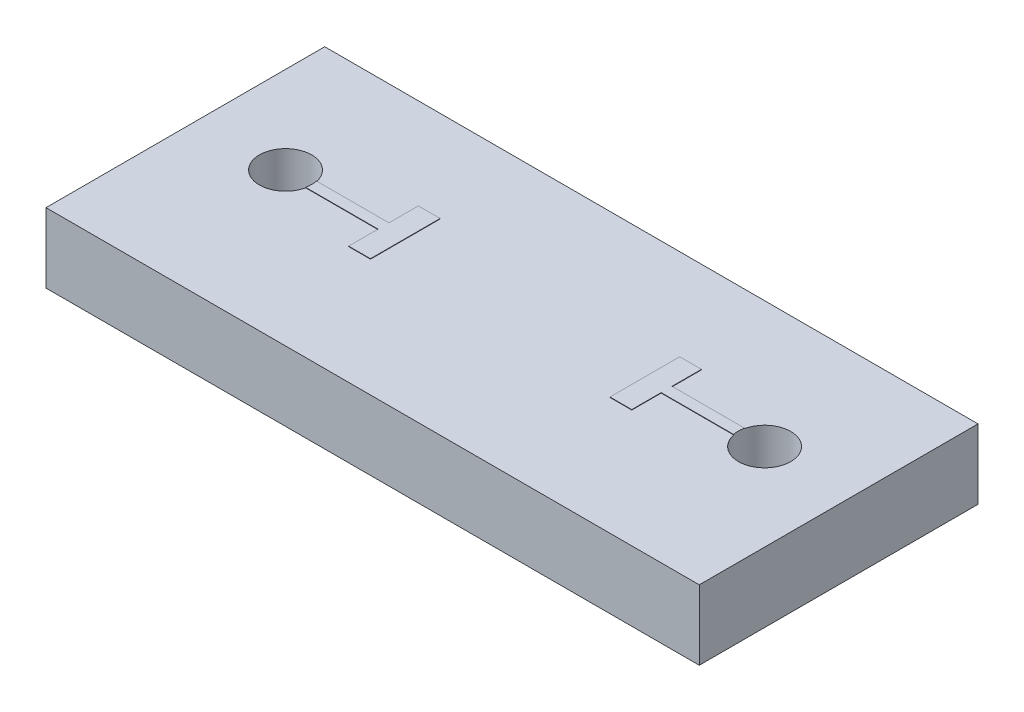
ISO-10303-21;
HEADER;
FILE_DESCRIPTION(('STEP AP214'),'2;1');
FILE_NAME('part.step','',(''),(''),'','','');
FILE_SCHEMA(('AUTOMOTIVE_DESIGN { 1 0 10303 214 1 1 1 1 }'));
ENDSEC;
DATA;
#1=APPLICATION_CONTEXT('core data for automotive mechanical design processes');
#2=APPLICATION_PROTOCOL_DEFINITION('international standard','automotive_design',2000,#1);
#3=PRODUCT_CONTEXT('',#1,'mechanical');
#4=PRODUCT('Part','Part','',(#3));
#5=PRODUCT_RELATED_PRODUCT_CATEGORY('part','',(#4));
#6=PRODUCT_DEFINITION_FORMATION('','',#4);
#7=PRODUCT_DEFINITION_CONTEXT('part definition',#1,'design');
#8=PRODUCT_DEFINITION('design','',#6,#7);
#9=PRODUCT_DEFINITION_SHAPE('','',#8);
#10=(LENGTH_UNIT() NAMED_UNIT(*) SI_UNIT(.MILLI.,.METRE.));
#11=(NAMED_UNIT(*) PLANE_ANGLE_UNIT() SI_UNIT($,.RADIAN.));
#12=(NAMED_UNIT(*) SI_UNIT($,.STERADIAN.) SOLID_ANGLE_UNIT());
#13=UNCERTAINTY_MEASURE_WITH_UNIT(LENGTH_MEASURE(1.E-05),#10,'distance_accuracy_value','');
#14=(GEOMETRIC_REPRESENTATION_CONTEXT(3) GLOBAL_UNCERTAINTY_ASSIGNED_CONTEXT((#13)) GLOBAL_UNIT_ASSIGNED_CONTEXT((#10,
#11,#12)) REPRESENTATION_CONTEXT('',''));
#15=CARTESIAN_POINT('',(0.,0.,0.));
#16=DIRECTION('',(0.,0.,1.));
#17=DIRECTION('',(1.,0.,0.));
#18=AXIS2_PLACEMENT_3D('',#15,#16,#17);
#19=CARTESIAN_POINT('',(0.,1.6,0.));
#20=DIRECTION('',(0.,-1.,0.));
#21=DIRECTION('',(0.,0.,-1.));
#22=AXIS2_PLACEMENT_3D('',#19,#20,#21);
#23=PLANE('',#22);
#24=DIRECTION('',(-1.,0.,0.));
#25=VECTOR('',#24,1.);
#26=CARTESIAN_POINT('',(0.,1.6,-0.124999999999995));
#27=LINE('',#26,#25);
#28=CARTESIAN_POINT('',(4.91316527028473,1.6,-0.12499999999999));
#29=VERTEX_POINT('',#28);
#30=CARTESIAN_POINT('',(3.25000000000001,1.6,-0.124999999999997));
#31=VERTEX_POINT('',#30);
#32=EDGE_CURVE('E232',#29,#31,#27,.T.);
#33=ORIENTED_EDGE('',*,*,#32,.F.);
#34=CARTESIAN_POINT('',(5.50000000000001,1.6,0.));
#35=DIRECTION('',(0.,1.,0.));
#36=DIRECTION('',(0.,0.,1.));
#37=AXIS2_PLACEMENT_3D('',#34,#35,#36);
#38=CIRCLE('',#37,0.6);
#39=CARTESIAN_POINT('',(4.91316527028473,1.6,0.125000000000004));
#40=VERTEX_POINT('',#39);
#41=EDGE_CURVE('E324',#40,#29,#38,.T.);
#42=ORIENTED_EDGE('',*,*,#41,.F.);
#43=DIRECTION('',(-1.,0.,0.));
#44=VECTOR('',#43,1.);
#45=CARTESIAN_POINT('',(0.,1.6,0.125));
#46=LINE('',#45,#44);
#47=CARTESIAN_POINT('',(3.25000000000001,1.6,0.124999999999995));
#48=VERTEX_POINT('',#47);
#49=EDGE_CURVE('E237',#40,#48,#46,.T.);
#50=ORIENTED_EDGE('',*,*,#49,.T.);
#51=DIRECTION('',(0.,0.,-1.));
#52=VECTOR('',#51,1.);
#53=CARTESIAN_POINT('',(3.25,1.6,0.));
#54=LINE('',#53,#52);
#55=CARTESIAN_POINT('',(3.25,1.6,0.799999999999999));
#56=VERTEX_POINT('',#55);
#57=EDGE_CURVE('E304',#56,#48,#54,.T.);
#58=ORIENTED_EDGE('',*,*,#57,.F.);
#59=DIRECTION('',(-1.,0.,0.));
#60=VECTOR('',#59,1.);
#61=CARTESIAN_POINT('',(0.,1.6,0.799999999999999));
#62=LINE('',#61,#60);
#63=CARTESIAN_POINT('',(2.75,1.59999999999999,0.800000000000004));
#64=VERTEX_POINT('',#63);
#65=EDGE_CURVE('E301',#56,#64,#62,.T.);
#66=ORIENTED_EDGE('',*,*,#65,.T.);
#67=DIRECTION('',(0.,0.,-1.));
#68=VECTOR('',#67,1.);
#69=CARTESIAN_POINT('',(2.75,1.6,0.));
#70=LINE('',#69,#68);
#71=CARTESIAN_POINT('',(2.75,1.6,-0.799999999999999));
#72=VERTEX_POINT('',#71);
#73=EDGE_CURVE('E285',#64,#72,#70,.T.);
#74=ORIENTED_EDGE('',*,*,#73,.T.);
#75=DIRECTION('',(-1.,0.,0.));
#76=VECTOR('',#75,1.);
#77=CARTESIAN_POINT('',(0.,1.6,-0.799999999999999));
#78=LINE('',#77,#76);
#79=CARTESIAN_POINT('',(3.25,1.6,-0.800000000000001));
#80=VERTEX_POINT('',#79);
#81=EDGE_CURVE('E290',#80,#72,#78,.T.);
#82=ORIENTED_EDGE('',*,*,#81,.F.);
#83=EDGE_CURVE('E303',#31,#80,#54,.T.);
#84=ORIENTED_EDGE('',*,*,#83,.F.);
#85=EDGE_LOOP('',(#33,#42,#50,#58,#66,#74,#82,#84));
#86=FACE_BOUND('',#85,.T.);
#87=DIRECTION('',(0.,0.,-1.));
#88=VECTOR('',#87,1.);
#89=CARTESIAN_POINT('',(7.5,1.6,2.00000000000001));
#90=LINE('',#89,#88);
#91=CARTESIAN_POINT('',(7.50000000000001,1.60000000000001,3.50000000000002));
#92=VERTEX_POINT('',#91);
#93=CARTESIAN_POINT('',(7.5,1.59999999999999,-2.9));
#94=VERTEX_POINT('',#93);
#95=EDGE_CURVE('E49',#92,#94,#90,.T.);
#96=ORIENTED_EDGE('',*,*,#95,.T.);
#97=DIRECTION('',(1.,0.,0.));
#98=VECTOR('',#97,1.);
#99=CARTESIAN_POINT('',(-7.5,1.6,-2.9));
#100=LINE('',#99,#98);
#101=CARTESIAN_POINT('',(-7.5,1.6,-2.9));
#102=VERTEX_POINT('',#101);
#103=EDGE_CURVE('E187',#102,#94,#100,.T.);
#104=ORIENTED_EDGE('',*,*,#103,.F.);
#105=DIRECTION('',(0.,0.,1.));
#106=VECTOR('',#105,1.);
#107=CARTESIAN_POINT('',(-7.5,1.6,2.00000000000001));
#108=LINE('',#107,#106);
#109=CARTESIAN_POINT('',(-7.5,1.6,3.50000000000001));
#110=VERTEX_POINT('',#109);
#111=EDGE_CURVE('E11',#102,#110,#108,.T.);
#112=ORIENTED_EDGE('',*,*,#111,.T.);
#113=DIRECTION('',(-1.,0.,0.));
#114=VECTOR('',#113,1.);
#115=CARTESIAN_POINT('',(-7.5,1.6,3.50000000000001));
#116=LINE('',#115,#114);
#117=EDGE_CURVE('E208',#92,#110,#116,.T.);
#118=ORIENTED_EDGE('',*,*,#117,.F.);
#119=EDGE_LOOP('',(#96,#104,#112,#118));
#120=FACE_BOUND('',#119,.T.);
#121=DIRECTION('',(1.,0.,0.));
#122=VECTOR('',#121,1.);
#123=CARTESIAN_POINT('',(0.,1.6,0.125));
#124=LINE('',#123,#122);
#125=CARTESIAN_POINT('',(-4.91316527028472,1.60000000000001,0.125000000000004));
#126=VERTEX_POINT('',#125);
#127=CARTESIAN_POINT('',(-3.25,1.6,0.125));
#128=VERTEX_POINT('',#127);
#129=EDGE_CURVE('E57',#126,#128,#124,.T.);
#130=ORIENTED_EDGE('',*,*,#129,.F.);
#131=CARTESIAN_POINT('',(-5.49999999999999,1.60000000000001,0.));
#132=DIRECTION('',(0.,1.,0.));
#133=DIRECTION('',(0.,0.,1.));
#134=AXIS2_PLACEMENT_3D('',#131,#132,#133);
#135=CIRCLE('',#134,0.6);
#136=CARTESIAN_POINT('',(-4.91316527028472,1.6,-0.124999999999998));
#137=VERTEX_POINT('',#136);
#138=EDGE_CURVE('E61',#126,#137,#135,.F.);
#139=ORIENTED_EDGE('',*,*,#138,.T.);
#140=DIRECTION('',(1.,0.,0.));
#141=VECTOR('',#140,1.);
#142=CARTESIAN_POINT('',(0.,1.6,-0.124999999999995));
#143=LINE('',#142,#141);
#144=CARTESIAN_POINT('',(-3.24999999999999,1.60000000000001,-0.125));
#145=VERTEX_POINT('',#144);
#146=EDGE_CURVE('E214',#137,#145,#143,.T.);
#147=ORIENTED_EDGE('',*,*,#146,.T.);
#148=DIRECTION('',(0.,0.,-1.));
#149=VECTOR('',#148,1.);
#150=CARTESIAN_POINT('',(-3.24999999999999,1.60000000000001,0.));
#151=LINE('',#150,#149);
#152=CARTESIAN_POINT('',(-3.24999999999999,1.60000000000001,-0.800000000000003));
#153=VERTEX_POINT('',#152);
#154=EDGE_CURVE('E254',#145,#153,#151,.T.);
#155=ORIENTED_EDGE('',*,*,#154,.T.);
#156=DIRECTION('',(1.,0.,0.));
#157=VECTOR('',#156,1.);
#158=CARTESIAN_POINT('',(0.,1.6,-0.799999999999999));
#159=LINE('',#158,#157);
#160=CARTESIAN_POINT('',(-2.74999999999999,1.60000000000001,-0.799999999999999));
#161=VERTEX_POINT('',#160);
#162=EDGE_CURVE('E272',#153,#161,#159,.T.);
#163=ORIENTED_EDGE('',*,*,#162,.T.);
#164=DIRECTION('',(0.,0.,-1.));
#165=VECTOR('',#164,1.);
#166=CARTESIAN_POINT('',(-2.74999999999999,1.60000000000001,0.));
#167=LINE('',#166,#165);
#168=CARTESIAN_POINT('',(-2.74999999999999,1.6,0.799999999999999));
#169=VERTEX_POINT('',#168);
#170=EDGE_CURVE('E270',#169,#161,#167,.T.);
#171=ORIENTED_EDGE('',*,*,#170,.F.);
#172=DIRECTION('',(1.,0.,0.));
#173=VECTOR('',#172,1.);
#174=CARTESIAN_POINT('',(0.,1.6,0.799999999999999));
#175=LINE('',#174,#173);
#176=CARTESIAN_POINT('',(-3.25,1.60000000000001,0.800000000000004));
#177=VERTEX_POINT('',#176);
#178=EDGE_CURVE('E268',#177,#169,#175,.T.);
#179=ORIENTED_EDGE('',*,*,#178,.F.);
#180=EDGE_CURVE('E266',#177,#128,#151,.T.);
#181=ORIENTED_EDGE('',*,*,#180,.T.);
#182=EDGE_LOOP('',(#130,#139,#147,#155,#163,#171,#179,#181));
#183=FACE_BOUND('',#182,.T.);
#184=ADVANCED_FACE('F40',(#86,#120,#183),#23,.F.);
#185=CARTESIAN_POINT('',(-3.24999999999999,1.61000000000001,0.));
#186=DIRECTION('',(-1.,0.,0.));
#187=DIRECTION('',(0.,0.,1.));
#188=AXIS2_PLACEMENT_3D('',#185,#186,#187);
#189=PLANE('',#188);
#190=DIRECTION('',(0.,0.,-1.));
#191=VECTOR('',#190,1.);
#192=CARTESIAN_POINT('',(-3.24999999999999,1.61000000000001,0.));
#193=LINE('',#192,#191);
#194=CARTESIAN_POINT('',(-3.25,1.61000000000001,0.800000000000006));
#195=VERTEX_POINT('',#194);
#196=CARTESIAN_POINT('',(-3.25,1.61000000000001,0.125000000000007));
#197=VERTEX_POINT('',#196);
#198=EDGE_CURVE('E255',#195,#197,#193,.T.);
#199=ORIENTED_EDGE('',*,*,#198,.T.);
#200=DIRECTION('',(0.,-1.,0.));
#201=VECTOR('',#200,1.);
#202=CARTESIAN_POINT('',(-3.25,1.61000000000001,0.125000000000007));
#203=LINE('',#202,#201);
#204=EDGE_CURVE('E227',#197,#128,#203,.T.);
#205=ORIENTED_EDGE('',*,*,#204,.T.);
#206=ORIENTED_EDGE('',*,*,#180,.F.);
#207=DIRECTION('',(0.,-1.,0.));
#208=VECTOR('',#207,1.);
#209=CARTESIAN_POINT('',(-3.25,1.61000000000001,0.800000000000006));
#210=LINE('',#209,#208);
#211=EDGE_CURVE('E283',#195,#177,#210,.T.);
#212=ORIENTED_EDGE('',*,*,#211,.F.);
#213=EDGE_LOOP('',(#199,#205,#206,#212));
#214=FACE_BOUND('',#213,.T.);
#215=ADVANCED_FACE('F349',(#214),#189,.T.);
#216=CARTESIAN_POINT('',(3.25,1.61,0.));
#217=DIRECTION('',(-1.,0.,0.));
#218=DIRECTION('',(0.,0.,1.));
#219=AXIS2_PLACEMENT_3D('',#216,#217,#218);
#220=PLANE('',#219);
#221=DIRECTION('',(0.,-1.,0.));
#222=VECTOR('',#221,1.);
#223=CARTESIAN_POINT('',(3.25000000000001,1.61,-0.124999999999993));
#224=LINE('',#223,#222);
#225=CARTESIAN_POINT('',(3.25000000000001,1.61,-0.124999999999993));
#226=VERTEX_POINT('',#225);
#227=EDGE_CURVE('E249',#226,#31,#224,.T.);
#228=ORIENTED_EDGE('',*,*,#227,.T.);
#229=ORIENTED_EDGE('',*,*,#83,.T.);
#230=DIRECTION('',(0.,-1.,0.));
#231=VECTOR('',#230,1.);
#232=CARTESIAN_POINT('',(3.25,1.61,-0.799999999999999));
#233=LINE('',#232,#231);
#234=CARTESIAN_POINT('',(3.25,1.61,-0.799999999999999));
#235=VERTEX_POINT('',#234);
#236=EDGE_CURVE('E311',#235,#80,#233,.T.);
#237=ORIENTED_EDGE('',*,*,#236,.F.);
#238=DIRECTION('',(0.,0.,-1.));
#239=VECTOR('',#238,1.);
#240=CARTESIAN_POINT('',(3.25,1.61,0.));
#241=LINE('',#240,#239);
#242=EDGE_CURVE('E293',#226,#235,#241,.T.);
#243=ORIENTED_EDGE('',*,*,#242,.F.);
#244=EDGE_LOOP('',(#228,#229,#237,#243));
#245=FACE_BOUND('',#244,.T.);
#246=ADVANCED_FACE('F345',(#245),#220,.F.);
#247=CARTESIAN_POINT('',(0.,0.,0.));
#248=DIRECTION('',(0.,-1.,0.));
#249=DIRECTION('',(0.,0.,-1.));
#250=AXIS2_PLACEMENT_3D('',#247,#248,#249);
#251=PLANE('',#250);
#252=CARTESIAN_POINT('',(-5.49999999999999,0.,0.));
#253=DIRECTION('',(0.,1.,0.));
#254=DIRECTION('',(0.,0.,1.));
#255=AXIS2_PLACEMENT_3D('',#252,#253,#254);
#256=CIRCLE('',#255,0.6);
#257=CARTESIAN_POINT('',(-5.49999999999999,0.,0.600000000000009));
#258=VERTEX_POINT('',#257);
#259=EDGE_CURVE('E327',#258,#258,#256,.F.);
#260=ORIENTED_EDGE('',*,*,#259,.F.);
#261=EDGE_LOOP('',(#260));
#262=FACE_BOUND('',#261,.T.);
#263=DIRECTION('',(0.,0.,-1.));
#264=VECTOR('',#263,1.);
#265=CARTESIAN_POINT('',(7.5,0.,2.00000000000001));
#266=LINE('',#265,#264);
#267=CARTESIAN_POINT('',(7.50000000000001,0.,3.50000000000002));
#268=VERTEX_POINT('',#267);
#269=CARTESIAN_POINT('',(7.50000000000001,0.,-2.9));
#270=VERTEX_POINT('',#269);
#271=EDGE_CURVE('E323',#268,#270,#266,.T.);
#272=ORIENTED_EDGE('',*,*,#271,.F.);
#273=DIRECTION('',(1.,0.,0.));
#274=VECTOR('',#273,1.);
#275=CARTESIAN_POINT('',(-7.49999999999999,0.,3.50000000000001));
#276=LINE('',#275,#274);
#277=CARTESIAN_POINT('',(-7.49999999999999,0.,3.50000000000001));
#278=VERTEX_POINT('',#277);
#279=EDGE_CURVE('E202',#278,#268,#276,.T.);
#280=ORIENTED_EDGE('',*,*,#279,.F.);
#281=DIRECTION('',(0.,0.,1.));
#282=VECTOR('',#281,1.);
#283=CARTESIAN_POINT('',(-7.49999999999999,0.,2.00000000000001));
#284=LINE('',#283,#282);
#285=CARTESIAN_POINT('',(-7.49999999999999,0.,-2.9));
#286=VERTEX_POINT('',#285);
#287=EDGE_CURVE('E44',#286,#278,#284,.T.);
#288=ORIENTED_EDGE('',*,*,#287,.F.);
#289=DIRECTION('',(-1.,0.,0.));
#290=VECTOR('',#289,1.);
#291=CARTESIAN_POINT('',(-7.49999999999999,0.,-2.9));
#292=LINE('',#291,#290);
#293=EDGE_CURVE('E196',#270,#286,#292,.T.);
#294=ORIENTED_EDGE('',*,*,#293,.F.);
#295=EDGE_LOOP('',(#272,#280,#288,#294));
#296=FACE_BOUND('',#295,.T.);
#297=CARTESIAN_POINT('',(5.5,0.,0.));
#298=DIRECTION('',(0.,1.,0.));
#299=DIRECTION('',(0.,0.,1.));
#300=AXIS2_PLACEMENT_3D('',#297,#298,#299);
#301=CIRCLE('',#300,0.6);
#302=CARTESIAN_POINT('',(5.5,0.,0.600000000000009));
#303=VERTEX_POINT('',#302);
#304=EDGE_CURVE('E320',#303,#303,#301,.T.);
#305=ORIENTED_EDGE('',*,*,#304,.T.);
#306=EDGE_LOOP('',(#305));
#307=FACE_BOUND('',#306,.T.);
#308=ADVANCED_FACE('F335',(#262,#296,#307),#251,.T.);
#309=CARTESIAN_POINT('',(7.5,1.6,2.00000000000001));
#310=DIRECTION('',(-1.,0.,0.));
#311=DIRECTION('',(0.,0.,1.));
#312=AXIS2_PLACEMENT_3D('',#309,#310,#311);
#313=PLANE('',#312);
#314=ORIENTED_EDGE('',*,*,#271,.T.);
#315=DIRECTION('',(0.,-1.,0.));
#316=VECTOR('',#315,1.);
#317=CARTESIAN_POINT('',(7.5,1.59999999999999,-2.9));
#318=LINE('',#317,#316);
#319=EDGE_CURVE('E191',#94,#270,#318,.T.);
#320=ORIENTED_EDGE('',*,*,#319,.F.);
#321=ORIENTED_EDGE('',*,*,#95,.F.);
#322=DIRECTION('',(0.,1.,0.));
#323=VECTOR('',#322,1.);
#324=CARTESIAN_POINT('',(7.50000000000001,1.60000000000001,3.50000000000002));
#325=LINE('',#324,#323);
#326=EDGE_CURVE('E205',#268,#92,#325,.T.);
#327=ORIENTED_EDGE('',*,*,#326,.F.);
#328=EDGE_LOOP('',(#314,#320,#321,#327));
#329=FACE_BOUND('',#328,.T.);
#330=ADVANCED_FACE('F42',(#329),#313,.F.);
#331=CARTESIAN_POINT('',(-7.5,1.6,2.00000000000001));
#332=DIRECTION('',(1.,0.,0.));
#333=DIRECTION('',(0.,0.,-1.));
#334=AXIS2_PLACEMENT_3D('',#331,#332,#333);
#335=PLANE('',#334);
#336=ORIENTED_EDGE('',*,*,#287,.T.);
#337=DIRECTION('',(0.,-1.,0.));
#338=VECTOR('',#337,1.);
#339=CARTESIAN_POINT('',(-7.5,1.6,3.50000000000001));
#340=LINE('',#339,#338);
#341=EDGE_CURVE('E182',#110,#278,#340,.T.);
#342=ORIENTED_EDGE('',*,*,#341,.F.);
#343=ORIENTED_EDGE('',*,*,#111,.F.);
#344=DIRECTION('',(0.,1.,0.));
#345=VECTOR('',#344,1.);
#346=CARTESIAN_POINT('',(-7.5,1.6,-2.9));
#347=LINE('',#346,#345);
#348=EDGE_CURVE('E180',#286,#102,#347,.T.);
#349=ORIENTED_EDGE('',*,*,#348,.F.);
#350=EDGE_LOOP('',(#336,#342,#343,#349));
#351=FACE_BOUND('',#350,.T.);
#352=ADVANCED_FACE('F178',(#351),#335,.F.);
#353=CARTESIAN_POINT('',(-5.49999999999999,0.,0.));
#354=DIRECTION('',(0.,1.,0.));
#355=DIRECTION('',(0.,0.,1.));
#356=AXIS2_PLACEMENT_3D('',#353,#354,#355);
#357=CYLINDRICAL_SURFACE('',#356,0.6);
#358=ORIENTED_EDGE('',*,*,#259,.T.);
#359=EDGE_LOOP('',(#358));
#360=FACE_BOUND('',#359,.T.);
#361=ORIENTED_EDGE('',*,*,#138,.F.);
#362=DIRECTION('',(0.,-1.,0.));
#363=VECTOR('',#362,1.);
#364=CARTESIAN_POINT('',(-4.91316527028472,1.61,0.125000000000009));
#365=LINE('',#364,#363);
#366=CARTESIAN_POINT('',(-4.91316527028472,1.61,0.125000000000009));
#367=VERTEX_POINT('',#366);
#368=EDGE_CURVE('E229',#367,#126,#365,.T.);
#369=ORIENTED_EDGE('',*,*,#368,.F.);
#370=CARTESIAN_POINT('',(-5.49999999999999,1.61000000000001,0.));
#371=DIRECTION('',(0.,1.,0.));
#372=DIRECTION('',(0.,0.,1.));
#373=AXIS2_PLACEMENT_3D('',#370,#371,#372);
#374=CIRCLE('',#373,0.6);
#375=CARTESIAN_POINT('',(-4.91316527028472,1.61,-0.125));
#376=VERTEX_POINT('',#375);
#377=EDGE_CURVE('E210',#376,#367,#374,.F.);
#378=ORIENTED_EDGE('',*,*,#377,.F.);
#379=DIRECTION('',(0.,-1.,0.));
#380=VECTOR('',#379,1.);
#381=CARTESIAN_POINT('',(-4.91316527028472,1.61,-0.125));
#382=LINE('',#381,#380);
#383=EDGE_CURVE('E220',#376,#137,#382,.T.);
#384=ORIENTED_EDGE('',*,*,#383,.T.);
#385=EDGE_LOOP('',(#361,#369,#378,#384));
#386=FACE_BOUND('',#385,.T.);
#387=ADVANCED_FACE('F344',(#360,#386),#357,.F.);
#388=CARTESIAN_POINT('',(5.5,0.,0.));
#389=DIRECTION('',(0.,1.,0.));
#390=DIRECTION('',(0.,0.,1.));
#391=AXIS2_PLACEMENT_3D('',#388,#389,#390);
#392=CYLINDRICAL_SURFACE('',#391,0.6);
#393=ORIENTED_EDGE('',*,*,#304,.F.);
#394=EDGE_LOOP('',(#393));
#395=FACE_BOUND('',#394,.T.);
#396=ORIENTED_EDGE('',*,*,#41,.T.);
#397=DIRECTION('',(0.,-1.,0.));
#398=VECTOR('',#397,1.);
#399=CARTESIAN_POINT('',(4.91316527028473,1.61,-0.12499999999999));
#400=LINE('',#399,#398);
#401=CARTESIAN_POINT('',(4.91316527028473,1.61,-0.12499999999999));
#402=VERTEX_POINT('',#401);
#403=EDGE_CURVE('E252',#402,#29,#400,.T.);
#404=ORIENTED_EDGE('',*,*,#403,.F.);
#405=CARTESIAN_POINT('',(5.50000000000001,1.61,0.));
#406=DIRECTION('',(0.,1.,0.));
#407=DIRECTION('',(0.,0.,1.));
#408=AXIS2_PLACEMENT_3D('',#405,#406,#407);
#409=CIRCLE('',#408,0.6);
#410=CARTESIAN_POINT('',(4.91316527028473,1.61,0.125000000000007));
#411=VERTEX_POINT('',#410);
#412=EDGE_CURVE('E233',#411,#402,#409,.F.);
#413=ORIENTED_EDGE('',*,*,#412,.F.);
#414=DIRECTION('',(0.,-1.,0.));
#415=VECTOR('',#414,1.);
#416=CARTESIAN_POINT('',(4.91316527028473,1.61,0.125000000000007));
#417=LINE('',#416,#415);
#418=EDGE_CURVE('E242',#411,#40,#417,.T.);
#419=ORIENTED_EDGE('',*,*,#418,.T.);
#420=EDGE_LOOP('',(#396,#404,#413,#419));
#421=FACE_BOUND('',#420,.T.);
#422=ADVANCED_FACE('F362',(#395,#421),#392,.F.);
#423=CARTESIAN_POINT('',(2.75,1.61,0.));
#424=DIRECTION('',(-1.,0.,0.));
#425=DIRECTION('',(0.,0.,1.));
#426=AXIS2_PLACEMENT_3D('',#423,#424,#425);
#427=PLANE('',#426);
#428=ORIENTED_EDGE('',*,*,#73,.F.);
#429=DIRECTION('',(0.,-1.,0.));
#430=VECTOR('',#429,1.);
#431=CARTESIAN_POINT('',(2.75,1.61,0.800000000000007));
#432=LINE('',#431,#430);
#433=CARTESIAN_POINT('',(2.75,1.61,0.800000000000007));
#434=VERTEX_POINT('',#433);
#435=EDGE_CURVE('E317',#434,#64,#432,.T.);
#436=ORIENTED_EDGE('',*,*,#435,.F.);
#437=DIRECTION('',(0.,0.,-1.));
#438=VECTOR('',#437,1.);
#439=CARTESIAN_POINT('',(2.75,1.61,0.));
#440=LINE('',#439,#438);
#441=CARTESIAN_POINT('',(2.75,1.61,-0.800000000000002));
#442=VERTEX_POINT('',#441);
#443=EDGE_CURVE('E286',#434,#442,#440,.T.);
#444=ORIENTED_EDGE('',*,*,#443,.T.);
#445=DIRECTION('',(0.,-1.,0.));
#446=VECTOR('',#445,1.);
#447=CARTESIAN_POINT('',(2.75,1.61,-0.800000000000002));
#448=LINE('',#447,#446);
#449=EDGE_CURVE('E299',#442,#72,#448,.T.);
#450=ORIENTED_EDGE('',*,*,#449,.T.);
#451=EDGE_LOOP('',(#428,#436,#444,#450));
#452=FACE_BOUND('',#451,.T.);
#453=ADVANCED_FACE('F366',(#452),#427,.T.);
#454=CARTESIAN_POINT('',(0.,1.61,0.800000000000006));
#455=DIRECTION('',(0.,0.,1.));
#456=DIRECTION('',(1.,0.,0.));
#457=AXIS2_PLACEMENT_3D('',#454,#455,#456);
#458=PLANE('',#457);
#459=ORIENTED_EDGE('',*,*,#65,.F.);
#460=DIRECTION('',(0.,-1.,0.));
#461=VECTOR('',#460,1.);
#462=CARTESIAN_POINT('',(3.25,1.61,0.800000000000009));
#463=LINE('',#462,#461);
#464=CARTESIAN_POINT('',(3.25,1.61,0.800000000000009));
#465=VERTEX_POINT('',#464);
#466=EDGE_CURVE('E314',#465,#56,#463,.T.);
#467=ORIENTED_EDGE('',*,*,#466,.F.);
#468=DIRECTION('',(-1.,0.,0.));
#469=VECTOR('',#468,1.);
#470=CARTESIAN_POINT('',(0.,1.61,0.800000000000006));
#471=LINE('',#470,#469);
#472=EDGE_CURVE('E289',#465,#434,#471,.T.);
#473=ORIENTED_EDGE('',*,*,#472,.T.);
#474=ORIENTED_EDGE('',*,*,#435,.T.);
#475=EDGE_LOOP('',(#459,#467,#473,#474));
#476=FACE_BOUND('',#475,.T.);
#477=ADVANCED_FACE('F370',(#476),#458,.T.);
#478=ORIENTED_EDGE('',*,*,#57,.T.);
#479=DIRECTION('',(0.,-1.,0.));
#480=VECTOR('',#479,1.);
#481=CARTESIAN_POINT('',(3.25000000000001,1.61,0.124999999999997));
#482=LINE('',#481,#480);
#483=CARTESIAN_POINT('',(3.25000000000001,1.61,0.124999999999997));
#484=VERTEX_POINT('',#483);
#485=EDGE_CURVE('E247',#484,#48,#482,.T.);
#486=ORIENTED_EDGE('',*,*,#485,.F.);
#487=EDGE_CURVE('E294',#465,#484,#241,.T.);
#488=ORIENTED_EDGE('',*,*,#487,.F.);
#489=ORIENTED_EDGE('',*,*,#466,.T.);
#490=EDGE_LOOP('',(#478,#486,#488,#489));
#491=FACE_BOUND('',#490,.T.);
#492=ADVANCED_FACE('F374',(#491),#220,.F.);
#493=CARTESIAN_POINT('',(0.,1.61,-0.799999999999999));
#494=DIRECTION('',(0.,0.,1.));
#495=DIRECTION('',(1.,0.,0.));
#496=AXIS2_PLACEMENT_3D('',#493,#494,#495);
#497=PLANE('',#496);
#498=ORIENTED_EDGE('',*,*,#81,.T.);
#499=ORIENTED_EDGE('',*,*,#449,.F.);
#500=DIRECTION('',(-1.,0.,0.));
#501=VECTOR('',#500,1.);
#502=CARTESIAN_POINT('',(0.,1.61,-0.799999999999999));
#503=LINE('',#502,#501);
#504=EDGE_CURVE('E297',#235,#442,#503,.T.);
#505=ORIENTED_EDGE('',*,*,#504,.F.);
#506=ORIENTED_EDGE('',*,*,#236,.T.);
#507=EDGE_LOOP('',(#498,#499,#505,#506));
#508=FACE_BOUND('',#507,.T.);
#509=ADVANCED_FACE('F378',(#508),#497,.F.);
#510=CARTESIAN_POINT('',(0.,1.61000000000001,0.));
#511=DIRECTION('',(0.,1.,0.));
#512=DIRECTION('',(0.,0.,1.));
#513=AXIS2_PLACEMENT_3D('',#510,#511,#512);
#514=PLANE('',#513);
#515=ORIENTED_EDGE('',*,*,#443,.F.);
#516=ORIENTED_EDGE('',*,*,#472,.F.);
#517=ORIENTED_EDGE('',*,*,#487,.T.);
#518=DIRECTION('',(-1.,0.,0.));
#519=VECTOR('',#518,1.);
#520=CARTESIAN_POINT('',(0.,1.61,0.125));
#521=LINE('',#520,#519);
#522=EDGE_CURVE('E240',#411,#484,#521,.T.);
#523=ORIENTED_EDGE('',*,*,#522,.F.);
#524=ORIENTED_EDGE('',*,*,#412,.T.);
#525=DIRECTION('',(-1.,0.,0.));
#526=VECTOR('',#525,1.);
#527=CARTESIAN_POINT('',(0.,1.61000000000001,-0.124999999999995));
#528=LINE('',#527,#526);
#529=EDGE_CURVE('E236',#402,#226,#528,.T.);
#530=ORIENTED_EDGE('',*,*,#529,.T.);
#531=ORIENTED_EDGE('',*,*,#242,.T.);
#532=ORIENTED_EDGE('',*,*,#504,.T.);
#533=EDGE_LOOP('',(#515,#516,#517,#523,#524,#530,#531,#532));
#534=FACE_BOUND('',#533,.T.);
#535=ADVANCED_FACE('F382',(#534),#514,.T.);
#536=DIRECTION('',(0.,-1.,0.));
#537=VECTOR('',#536,1.);
#538=CARTESIAN_POINT('',(-3.24999999999999,1.61,-0.124999999999997));
#539=LINE('',#538,#537);
#540=CARTESIAN_POINT('',(-3.24999999999999,1.61,-0.124999999999997));
#541=VERTEX_POINT('',#540);
#542=EDGE_CURVE('E224',#541,#145,#539,.T.);
#543=ORIENTED_EDGE('',*,*,#542,.F.);
#544=CARTESIAN_POINT('',(-3.24999999999999,1.61000000000001,-0.799999999999999));
#545=VERTEX_POINT('',#544);
#546=EDGE_CURVE('E258',#541,#545,#193,.T.);
#547=ORIENTED_EDGE('',*,*,#546,.T.);
#548=DIRECTION('',(0.,-1.,0.));
#549=VECTOR('',#548,1.);
#550=CARTESIAN_POINT('',(-3.24999999999999,1.61000000000001,-0.799999999999999));
#551=LINE('',#550,#549);
#552=EDGE_CURVE('E265',#545,#153,#551,.T.);
#553=ORIENTED_EDGE('',*,*,#552,.T.);
#554=ORIENTED_EDGE('',*,*,#154,.F.);
#555=EDGE_LOOP('',(#543,#547,#553,#554));
#556=FACE_BOUND('',#555,.T.);
#557=ADVANCED_FACE('F357',(#556),#189,.T.);
#558=CARTESIAN_POINT('',(0.,1.61,0.800000000000006));
#559=DIRECTION('',(0.,0.,-1.));
#560=DIRECTION('',(-1.,0.,0.));
#561=AXIS2_PLACEMENT_3D('',#558,#559,#560);
#562=PLANE('',#561);
#563=ORIENTED_EDGE('',*,*,#178,.T.);
#564=DIRECTION('',(0.,-1.,0.));
#565=VECTOR('',#564,1.);
#566=CARTESIAN_POINT('',(-2.74999999999999,1.61,0.800000000000006));
#567=LINE('',#566,#565);
#568=CARTESIAN_POINT('',(-2.74999999999999,1.61,0.800000000000006));
#569=VERTEX_POINT('',#568);
#570=EDGE_CURVE('E280',#569,#169,#567,.T.);
#571=ORIENTED_EDGE('',*,*,#570,.F.);
#572=DIRECTION('',(1.,0.,0.));
#573=VECTOR('',#572,1.);
#574=CARTESIAN_POINT('',(0.,1.61,0.800000000000006));
#575=LINE('',#574,#573);
#576=EDGE_CURVE('E257',#195,#569,#575,.T.);
#577=ORIENTED_EDGE('',*,*,#576,.F.);
#578=ORIENTED_EDGE('',*,*,#211,.T.);
#579=EDGE_LOOP('',(#563,#571,#577,#578));
#580=FACE_BOUND('',#579,.T.);
#581=ADVANCED_FACE('F388',(#580),#562,.F.);
#582=CARTESIAN_POINT('',(-2.74999999999999,1.61,0.));
#583=DIRECTION('',(-1.,0.,0.));
#584=DIRECTION('',(0.,0.,1.));
#585=AXIS2_PLACEMENT_3D('',#582,#583,#584);
#586=PLANE('',#585);
#587=ORIENTED_EDGE('',*,*,#170,.T.);
#588=DIRECTION('',(0.,-1.,0.));
#589=VECTOR('',#588,1.);
#590=CARTESIAN_POINT('',(-2.74999999999999,1.61000000000001,-0.800000000000003));
#591=LINE('',#590,#589);
#592=CARTESIAN_POINT('',(-2.74999999999999,1.61000000000001,-0.800000000000003));
#593=VERTEX_POINT('',#592);
#594=EDGE_CURVE('E277',#593,#161,#591,.T.);
#595=ORIENTED_EDGE('',*,*,#594,.F.);
#596=DIRECTION('',(0.,0.,-1.));
#597=VECTOR('',#596,1.);
#598=CARTESIAN_POINT('',(-2.74999999999999,1.61,0.));
#599=LINE('',#598,#597);
#600=EDGE_CURVE('E260',#569,#593,#599,.T.);
#601=ORIENTED_EDGE('',*,*,#600,.F.);
#602=ORIENTED_EDGE('',*,*,#570,.T.);
#603=EDGE_LOOP('',(#587,#595,#601,#602));
#604=FACE_BOUND('',#603,.T.);
#605=ADVANCED_FACE('F392',(#604),#586,.F.);
#606=CARTESIAN_POINT('',(0.,1.61,-0.799999999999999));
#607=DIRECTION('',(0.,0.,-1.));
#608=DIRECTION('',(-1.,0.,0.));
#609=AXIS2_PLACEMENT_3D('',#606,#607,#608);
#610=PLANE('',#609);
#611=ORIENTED_EDGE('',*,*,#162,.F.);
#612=ORIENTED_EDGE('',*,*,#552,.F.);
#613=DIRECTION('',(1.,0.,0.));
#614=VECTOR('',#613,1.);
#615=CARTESIAN_POINT('',(0.,1.61,-0.799999999999999));
#616=LINE('',#615,#614);
#617=EDGE_CURVE('E262',#545,#593,#616,.T.);
#618=ORIENTED_EDGE('',*,*,#617,.T.);
#619=ORIENTED_EDGE('',*,*,#594,.T.);
#620=EDGE_LOOP('',(#611,#612,#618,#619));
#621=FACE_BOUND('',#620,.T.);
#622=ADVANCED_FACE('F396',(#621),#610,.T.);
#623=CARTESIAN_POINT('',(0.,1.61000000000001,0.));
#624=DIRECTION('',(0.,1.,0.));
#625=DIRECTION('',(0.,0.,1.));
#626=AXIS2_PLACEMENT_3D('',#623,#624,#625);
#627=PLANE('',#626);
#628=ORIENTED_EDGE('',*,*,#198,.F.);
#629=ORIENTED_EDGE('',*,*,#576,.T.);
#630=ORIENTED_EDGE('',*,*,#600,.T.);
#631=ORIENTED_EDGE('',*,*,#617,.F.);
#632=ORIENTED_EDGE('',*,*,#546,.F.);
#633=DIRECTION('',(1.,0.,0.));
#634=VECTOR('',#633,1.);
#635=CARTESIAN_POINT('',(0.,1.61000000000001,-0.124999999999995));
#636=LINE('',#635,#634);
#637=EDGE_CURVE('E217',#376,#541,#636,.T.);
#638=ORIENTED_EDGE('',*,*,#637,.F.);
#639=ORIENTED_EDGE('',*,*,#377,.T.);
#640=DIRECTION('',(1.,0.,0.));
#641=VECTOR('',#640,1.);
#642=CARTESIAN_POINT('',(0.,1.61,0.125));
#643=LINE('',#642,#641);
#644=EDGE_CURVE('E213',#367,#197,#643,.T.);
#645=ORIENTED_EDGE('',*,*,#644,.T.);
#646=EDGE_LOOP('',(#628,#629,#630,#631,#632,#638,#639,#645));
#647=FACE_BOUND('',#646,.T.);
#648=ADVANCED_FACE('F400',(#647),#627,.T.);
#649=CARTESIAN_POINT('',(0.,1.61000000000001,-0.124999999999995));
#650=DIRECTION('',(0.,0.,1.));
#651=DIRECTION('',(1.,0.,0.));
#652=AXIS2_PLACEMENT_3D('',#649,#650,#651);
#653=PLANE('',#652);
#654=ORIENTED_EDGE('',*,*,#32,.T.);
#655=ORIENTED_EDGE('',*,*,#227,.F.);
#656=ORIENTED_EDGE('',*,*,#529,.F.);
#657=ORIENTED_EDGE('',*,*,#403,.T.);
#658=EDGE_LOOP('',(#654,#655,#656,#657));
#659=FACE_BOUND('',#658,.T.);
#660=ADVANCED_FACE('F404',(#659),#653,.F.);
#661=CARTESIAN_POINT('',(0.,1.61,0.125));
#662=DIRECTION('',(0.,0.,1.));
#663=DIRECTION('',(1.,0.,0.));
#664=AXIS2_PLACEMENT_3D('',#661,#662,#663);
#665=PLANE('',#664);
#666=ORIENTED_EDGE('',*,*,#49,.F.);
#667=ORIENTED_EDGE('',*,*,#418,.F.);
#668=ORIENTED_EDGE('',*,*,#522,.T.);
#669=ORIENTED_EDGE('',*,*,#485,.T.);
#670=EDGE_LOOP('',(#666,#667,#668,#669));
#671=FACE_BOUND('',#670,.T.);
#672=ADVANCED_FACE('F408',(#671),#665,.T.);
#673=CARTESIAN_POINT('',(0.,1.61,0.125));
#674=DIRECTION('',(0.,0.,-1.));
#675=DIRECTION('',(-1.,0.,0.));
#676=AXIS2_PLACEMENT_3D('',#673,#674,#675);
#677=PLANE('',#676);
#678=ORIENTED_EDGE('',*,*,#129,.T.);
#679=ORIENTED_EDGE('',*,*,#204,.F.);
#680=ORIENTED_EDGE('',*,*,#644,.F.);
#681=ORIENTED_EDGE('',*,*,#368,.T.);
#682=EDGE_LOOP('',(#678,#679,#680,#681));
#683=FACE_BOUND('',#682,.T.);
#684=ADVANCED_FACE('F412',(#683),#677,.F.);
#685=CARTESIAN_POINT('',(0.,1.61000000000001,-0.124999999999995));
#686=DIRECTION('',(0.,0.,-1.));
#687=DIRECTION('',(-1.,0.,0.));
#688=AXIS2_PLACEMENT_3D('',#685,#686,#687);
#689=PLANE('',#688);
#690=ORIENTED_EDGE('',*,*,#146,.F.);
#691=ORIENTED_EDGE('',*,*,#383,.F.);
#692=ORIENTED_EDGE('',*,*,#637,.T.);
#693=ORIENTED_EDGE('',*,*,#542,.T.);
#694=EDGE_LOOP('',(#690,#691,#692,#693));
#695=FACE_BOUND('',#694,.T.);
#696=ADVANCED_FACE('F416',(#695),#689,.T.);
#697=CARTESIAN_POINT('',(0.,0.,3.50000000000002));
#698=DIRECTION('',(0.,0.,1.));
#699=DIRECTION('',(1.,0.,0.));
#700=AXIS2_PLACEMENT_3D('',#697,#698,#699);
#701=PLANE('',#700);
#702=ORIENTED_EDGE('',*,*,#341,.T.);
#703=ORIENTED_EDGE('',*,*,#279,.T.);
#704=ORIENTED_EDGE('',*,*,#326,.T.);
#705=ORIENTED_EDGE('',*,*,#117,.T.);
#706=EDGE_LOOP('',(#702,#703,#704,#705));
#707=FACE_BOUND('',#706,.T.);
#708=ADVANCED_FACE('F338',(#707),#701,.T.);
#709=CARTESIAN_POINT('',(0.,0.,-2.9));
#710=DIRECTION('',(0.,0.,1.));
#711=DIRECTION('',(1.,0.,0.));
#712=AXIS2_PLACEMENT_3D('',#709,#710,#711);
#713=PLANE('',#712);
#714=ORIENTED_EDGE('',*,*,#348,.T.);
#715=ORIENTED_EDGE('',*,*,#103,.T.);
#716=ORIENTED_EDGE('',*,*,#319,.T.);
#717=ORIENTED_EDGE('',*,*,#293,.T.);
#718=EDGE_LOOP('',(#714,#715,#716,#717));
#719=FACE_BOUND('',#718,.T.);
#720=ADVANCED_FACE('F194',(#719),#713,.F.);
#721=CLOSED_SHELL('',(#184,#215,#246,#308,#330,#352,#387,#422,#453,#477,#492,#509,#535,#557,
#581,#605,#622,#648,#660,#672,#684,#696,#708,#720));
#722=MANIFOLD_SOLID_BREP('B2',#721);
#723=ADVANCED_BREP_SHAPE_REPRESENTATION('',(#18,#722),#14);
#724=SHAPE_DEFINITION_REPRESENTATION(#9,#723);
ENDSEC;
END-ISO-10303-21;
